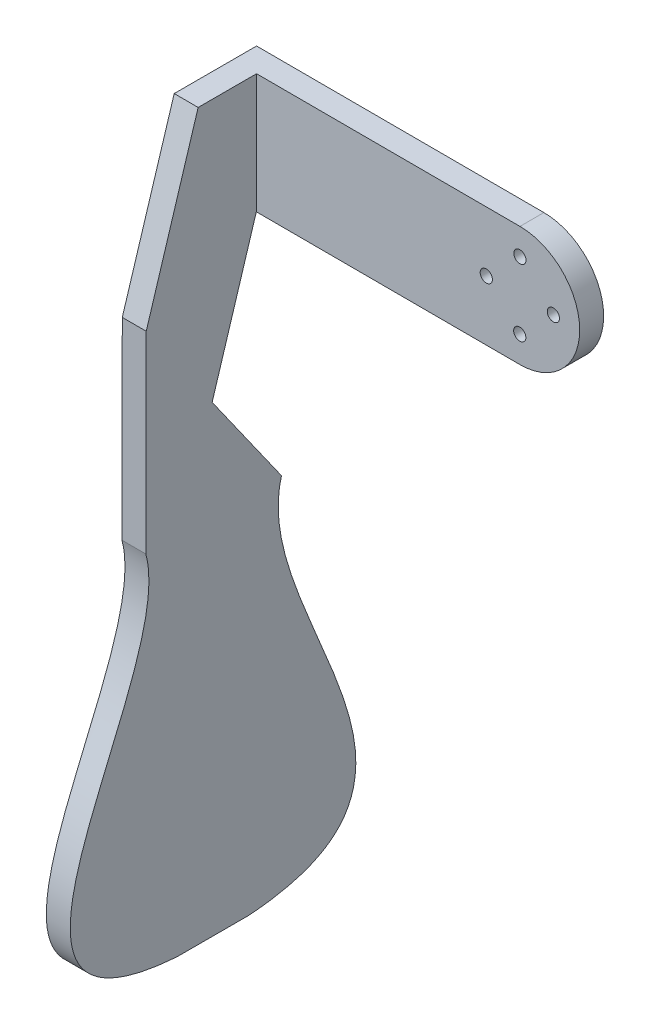
ISO-10303-21;
HEADER;
FILE_DESCRIPTION(('STEP AP214'),'2;1');
FILE_NAME('part.step','',(''),(''),'','','');
FILE_SCHEMA(('AUTOMOTIVE_DESIGN { 1 0 10303 214 1 1 1 1 }'));
ENDSEC;
DATA;
#1=APPLICATION_CONTEXT('core data for automotive mechanical design processes');
#2=APPLICATION_PROTOCOL_DEFINITION('international standard','automotive_design',2000,#1);
#3=PRODUCT_CONTEXT('',#1,'mechanical');
#4=PRODUCT('Part','Part','',(#3));
#5=PRODUCT_RELATED_PRODUCT_CATEGORY('part','',(#4));
#6=PRODUCT_DEFINITION_FORMATION('','',#4);
#7=PRODUCT_DEFINITION_CONTEXT('part definition',#1,'design');
#8=PRODUCT_DEFINITION('design','',#6,#7);
#9=PRODUCT_DEFINITION_SHAPE('','',#8);
#10=(LENGTH_UNIT() NAMED_UNIT(*) SI_UNIT(.MILLI.,.METRE.));
#11=(NAMED_UNIT(*) PLANE_ANGLE_UNIT() SI_UNIT($,.RADIAN.));
#12=(NAMED_UNIT(*) SI_UNIT($,.STERADIAN.) SOLID_ANGLE_UNIT());
#13=UNCERTAINTY_MEASURE_WITH_UNIT(LENGTH_MEASURE(1.E-05),#10,'distance_accuracy_value','');
#14=(GEOMETRIC_REPRESENTATION_CONTEXT(3) GLOBAL_UNCERTAINTY_ASSIGNED_CONTEXT((#13)) GLOBAL_UNIT_ASSIGNED_CONTEXT((#10,
#11,#12)) REPRESENTATION_CONTEXT('',''));
#15=CARTESIAN_POINT('',(0.,0.,0.));
#16=DIRECTION('',(0.,0.,1.));
#17=DIRECTION('',(1.,0.,0.));
#18=AXIS2_PLACEMENT_3D('',#15,#16,#17);
#19=CARTESIAN_POINT('',(0.,0.,3.));
#20=DIRECTION('',(0.,0.,1.));
#21=DIRECTION('',(1.,0.,0.));
#22=AXIS2_PLACEMENT_3D('',#19,#20,#21);
#23=PLANE('',#22);
#24=DIRECTION('',(-0.0020363344066826,-0.999997926668943,0.));
#25=VECTOR('',#24,1.);
#26=CARTESIAN_POINT('',(-54.9744317867084,12.6119724757293,3.));
#27=LINE('',#26,#25);
#28=CARTESIAN_POINT('',(-54.9744317867084,12.6119724757293,3.));
#29=VERTEX_POINT('',#28);
#30=CARTESIAN_POINT('',(-55.0253401468754,-12.3879756909943,3.));
#31=VERTEX_POINT('',#30);
#32=EDGE_CURVE('E49',#29,#31,#27,.T.);
#33=ORIENTED_EDGE('',*,*,#32,.T.);
#34=DIRECTION('',(0.999997926668943,-0.00203633440668162,0.));
#35=VECTOR('',#34,1.);
#36=CARTESIAN_POINT('',(-0.0254541800835499,-12.4999740833618,3.));
#37=LINE('',#36,#35);
#38=CARTESIAN_POINT('',(-0.0254541800835499,-12.4999740833618,3.));
#39=VERTEX_POINT('',#38);
#40=EDGE_CURVE('E249',#31,#39,#37,.T.);
#41=ORIENTED_EDGE('',*,*,#40,.T.);
#42=CARTESIAN_POINT('',(0.,0.,3.));
#43=DIRECTION('',(0.,0.,1.));
#44=DIRECTION('',(1.,0.,0.));
#45=AXIS2_PLACEMENT_3D('',#42,#43,#44);
#46=CIRCLE('',#45,12.5);
#47=CARTESIAN_POINT('',(0.0254541800835013,12.4999740833618,3.));
#48=VERTEX_POINT('',#47);
#49=EDGE_CURVE('E226',#39,#48,#46,.T.);
#50=ORIENTED_EDGE('',*,*,#49,.T.);
#51=DIRECTION('',(-0.999997926668943,0.00203633440668255,0.));
#52=VECTOR('',#51,1.);
#53=CARTESIAN_POINT('',(0.0254541800835013,12.4999740833618,3.));
#54=LINE('',#53,#52);
#55=EDGE_CURVE('E54',#48,#29,#54,.T.);
#56=ORIENTED_EDGE('',*,*,#55,.T.);
#57=EDGE_LOOP('',(#33,#41,#50,#56));
#58=FACE_BOUND('',#57,.T.);
#59=CARTESIAN_POINT('',(0.0142543408467484,6.99998548668259,3.));
#60=DIRECTION('',(0.,0.,1.));
#61=DIRECTION('',(-1.,0.,0.));
#62=AXIS2_PLACEMENT_3D('',#59,#60,#61);
#63=CIRCLE('',#62,1.275);
#64=CARTESIAN_POINT('',(-1.26074565915325,6.99998548668259,3.));
#65=VERTEX_POINT('',#64);
#66=EDGE_CURVE('E262',#65,#65,#63,.T.);
#67=ORIENTED_EDGE('',*,*,#66,.F.);
#68=EDGE_LOOP('',(#67));
#69=FACE_BOUND('',#68,.T.);
#70=CARTESIAN_POINT('',(6.99998548668257,-0.0142543408467744,3.));
#71=DIRECTION('',(0.,0.,1.));
#72=DIRECTION('',(1.,0.,0.));
#73=AXIS2_PLACEMENT_3D('',#70,#71,#72);
#74=CIRCLE('',#73,1.27499999999999);
#75=CARTESIAN_POINT('',(8.27498548668256,-0.0142543408467744,3.));
#76=VERTEX_POINT('',#75);
#77=EDGE_CURVE('E11',#76,#76,#74,.T.);
#78=ORIENTED_EDGE('',*,*,#77,.F.);
#79=EDGE_LOOP('',(#78));
#80=FACE_BOUND('',#79,.T.);
#81=CARTESIAN_POINT('',(-6.99998548668262,0.0142543408467753,3.));
#82=DIRECTION('',(0.,0.,1.));
#83=DIRECTION('',(-1.,0.,0.));
#84=AXIS2_PLACEMENT_3D('',#81,#82,#83);
#85=CIRCLE('',#84,1.275);
#86=CARTESIAN_POINT('',(-8.27498548668262,0.0142543408467753,3.));
#87=VERTEX_POINT('',#86);
#88=EDGE_CURVE('E42',#87,#87,#85,.T.);
#89=ORIENTED_EDGE('',*,*,#88,.F.);
#90=EDGE_LOOP('',(#89));
#91=FACE_BOUND('',#90,.T.);
#92=CARTESIAN_POINT('',(-0.0142543408468025,-6.9999854866826,3.));
#93=DIRECTION('',(0.,0.,1.));
#94=DIRECTION('',(1.,0.,0.));
#95=AXIS2_PLACEMENT_3D('',#92,#93,#94);
#96=CIRCLE('',#95,1.275);
#97=CARTESIAN_POINT('',(1.26074565915319,-6.9999854866826,3.));
#98=VERTEX_POINT('',#97);
#99=EDGE_CURVE('E255',#98,#98,#96,.T.);
#100=ORIENTED_EDGE('',*,*,#99,.F.);
#101=EDGE_LOOP('',(#100));
#102=FACE_BOUND('',#101,.T.);
#103=ADVANCED_FACE('F35',(#58,#69,#80,#91,#102),#23,.T.);
#104=CARTESIAN_POINT('',(6.99998548668257,-0.0142543408467744,3.));
#105=DIRECTION('',(0.,0.,-1.));
#106=DIRECTION('',(-1.,0.,0.));
#107=AXIS2_PLACEMENT_3D('',#104,#105,#106);
#108=CYLINDRICAL_SURFACE('',#107,1.27499999999999);
#109=ORIENTED_EDGE('',*,*,#77,.T.);
#110=EDGE_LOOP('',(#109));
#111=FACE_BOUND('',#110,.T.);
#112=CARTESIAN_POINT('',(6.99998548668257,-0.0142543408467744,-2.));
#113=DIRECTION('',(0.,0.,1.));
#114=DIRECTION('',(1.,0.,0.));
#115=AXIS2_PLACEMENT_3D('',#112,#113,#114);
#116=CIRCLE('',#115,1.275);
#117=CARTESIAN_POINT('',(8.27498548668257,-0.0142543408467744,-2.));
#118=VERTEX_POINT('',#117);
#119=EDGE_CURVE('E224',#118,#118,#116,.T.);
#120=ORIENTED_EDGE('',*,*,#119,.F.);
#121=EDGE_LOOP('',(#120));
#122=FACE_BOUND('',#121,.T.);
#123=ADVANCED_FACE('F213',(#111,#122),#108,.F.);
#124=CARTESIAN_POINT('',(-6.99998548668262,0.0142543408467753,3.));
#125=DIRECTION('',(0.,0.,-1.));
#126=DIRECTION('',(-1.,0.,0.));
#127=AXIS2_PLACEMENT_3D('',#124,#125,#126);
#128=CYLINDRICAL_SURFACE('',#127,1.275);
#129=ORIENTED_EDGE('',*,*,#88,.T.);
#130=EDGE_LOOP('',(#129));
#131=FACE_BOUND('',#130,.T.);
#132=CARTESIAN_POINT('',(-6.99998548668262,0.014254340846777,-2.));
#133=DIRECTION('',(0.,0.,1.));
#134=DIRECTION('',(-1.,0.,0.));
#135=AXIS2_PLACEMENT_3D('',#132,#133,#134);
#136=CIRCLE('',#135,1.275);
#137=CARTESIAN_POINT('',(-8.27498548668262,0.014254340846777,-2.));
#138=VERTEX_POINT('',#137);
#139=EDGE_CURVE('E227',#138,#138,#136,.T.);
#140=ORIENTED_EDGE('',*,*,#139,.F.);
#141=EDGE_LOOP('',(#140));
#142=FACE_BOUND('',#141,.T.);
#143=ADVANCED_FACE('F210',(#131,#142),#128,.F.);
#144=CARTESIAN_POINT('',(0.0142543408467484,6.99998548668259,3.));
#145=DIRECTION('',(0.,0.,-1.));
#146=DIRECTION('',(-1.,0.,0.));
#147=AXIS2_PLACEMENT_3D('',#144,#145,#146);
#148=CYLINDRICAL_SURFACE('',#147,1.275);
#149=ORIENTED_EDGE('',*,*,#66,.T.);
#150=EDGE_LOOP('',(#149));
#151=FACE_BOUND('',#150,.T.);
#152=CARTESIAN_POINT('',(0.0142543408467449,6.9999854866826,-2.));
#153=DIRECTION('',(0.,0.,1.));
#154=DIRECTION('',(-1.,0.,0.));
#155=AXIS2_PLACEMENT_3D('',#152,#153,#154);
#156=CIRCLE('',#155,1.275);
#157=CARTESIAN_POINT('',(-1.26074565915326,6.9999854866826,-2.));
#158=VERTEX_POINT('',#157);
#159=EDGE_CURVE('E231',#158,#158,#156,.T.);
#160=ORIENTED_EDGE('',*,*,#159,.F.);
#161=EDGE_LOOP('',(#160));
#162=FACE_BOUND('',#161,.T.);
#163=ADVANCED_FACE('F206',(#151,#162),#148,.F.);
#164=CARTESIAN_POINT('',(-0.0142543408468025,-6.9999854866826,3.));
#165=DIRECTION('',(0.,0.,-1.));
#166=DIRECTION('',(-1.,0.,0.));
#167=AXIS2_PLACEMENT_3D('',#164,#165,#166);
#168=CYLINDRICAL_SURFACE('',#167,1.275);
#169=ORIENTED_EDGE('',*,*,#99,.T.);
#170=EDGE_LOOP('',(#169));
#171=FACE_BOUND('',#170,.T.);
#172=CARTESIAN_POINT('',(-0.014254340846803,-6.9999854866826,-2.));
#173=DIRECTION('',(0.,0.,1.));
#174=DIRECTION('',(1.,0.,0.));
#175=AXIS2_PLACEMENT_3D('',#172,#173,#174);
#176=CIRCLE('',#175,1.275);
#177=CARTESIAN_POINT('',(1.2607456591532,-6.9999854866826,-2.));
#178=VERTEX_POINT('',#177);
#179=EDGE_CURVE('E273',#178,#178,#176,.T.);
#180=ORIENTED_EDGE('',*,*,#179,.F.);
#181=EDGE_LOOP('',(#180));
#182=FACE_BOUND('',#181,.T.);
#183=ADVANCED_FACE('F202',(#171,#182),#168,.F.);
#184=CARTESIAN_POINT('',(0.,0.,-2.));
#185=DIRECTION('',(0.,0.,1.));
#186=DIRECTION('',(1.,0.,0.));
#187=AXIS2_PLACEMENT_3D('',#184,#185,#186);
#188=CYLINDRICAL_SURFACE('',#187,12.5);
#189=ORIENTED_EDGE('',*,*,#49,.F.);
#190=DIRECTION('',(0.,0.,1.));
#191=VECTOR('',#190,1.);
#192=CARTESIAN_POINT('',(-0.0254541800835499,-12.4999740833618,-2.));
#193=LINE('',#192,#191);
#194=CARTESIAN_POINT('',(-0.0254541800835499,-12.4999740833618,-2.));
#195=VERTEX_POINT('',#194);
#196=EDGE_CURVE('E252',#195,#39,#193,.T.);
#197=ORIENTED_EDGE('',*,*,#196,.F.);
#198=CARTESIAN_POINT('',(0.,0.,-2.));
#199=DIRECTION('',(0.,0.,1.));
#200=DIRECTION('',(1.,0.,0.));
#201=AXIS2_PLACEMENT_3D('',#198,#199,#200);
#202=CIRCLE('',#201,12.5);
#203=CARTESIAN_POINT('',(0.0254541800835013,12.4999740833618,-2.));
#204=VERTEX_POINT('',#203);
#205=EDGE_CURVE('E235',#195,#204,#202,.T.);
#206=ORIENTED_EDGE('',*,*,#205,.T.);
#207=DIRECTION('',(0.,0.,1.));
#208=VECTOR('',#207,1.);
#209=CARTESIAN_POINT('',(0.0254541800835013,12.4999740833618,-2.));
#210=LINE('',#209,#208);
#211=EDGE_CURVE('E246',#204,#48,#210,.T.);
#212=ORIENTED_EDGE('',*,*,#211,.T.);
#213=EDGE_LOOP('',(#189,#197,#206,#212));
#214=FACE_BOUND('',#213,.T.);
#215=ADVANCED_FACE('F193',(#214),#188,.T.);
#216=CARTESIAN_POINT('',(-0.0254541800835499,-12.4999740833618,-2.));
#217=DIRECTION('',(-0.00203633440668162,-0.999997926668943,0.));
#218=DIRECTION('',(0.999997926668943,-0.00203633440668162,0.));
#219=AXIS2_PLACEMENT_3D('',#216,#217,#218);
#220=PLANE('',#219);
#221=CARTESIAN_POINT('',(-60.0253297802201,-12.3777940189609,3.));
#222=VERTEX_POINT('',#221);
#223=EDGE_CURVE('E239',#222,#31,#37,.T.);
#224=ORIENTED_EDGE('',*,*,#223,.F.);
#225=DIRECTION('',(0.,0.,1.));
#226=VECTOR('',#225,1.);
#227=CARTESIAN_POINT('',(-60.0253297802201,-12.3777940189609,-2.));
#228=LINE('',#227,#226);
#229=CARTESIAN_POINT('',(-60.0253297802201,-12.3777940189609,-2.));
#230=VERTEX_POINT('',#229);
#231=EDGE_CURVE('E256',#230,#222,#228,.T.);
#232=ORIENTED_EDGE('',*,*,#231,.F.);
#233=DIRECTION('',(0.999997926668943,-0.00203633440668162,0.));
#234=VECTOR('',#233,1.);
#235=CARTESIAN_POINT('',(-0.0254541800835499,-12.4999740833618,-2.));
#236=LINE('',#235,#234);
#237=EDGE_CURVE('E244',#230,#195,#236,.T.);
#238=ORIENTED_EDGE('',*,*,#237,.T.);
#239=ORIENTED_EDGE('',*,*,#196,.T.);
#240=ORIENTED_EDGE('',*,*,#40,.F.);
#241=EDGE_LOOP('',(#224,#232,#238,#239,#240));
#242=FACE_BOUND('',#241,.T.);
#243=ADVANCED_FACE('F189',(#242),#220,.T.);
#244=CARTESIAN_POINT('',(-60.0253297802201,-12.3777940189609,-2.));
#245=DIRECTION('',(-0.999997926668943,0.00203633440668233,0.));
#246=DIRECTION('',(-0.00203633440668233,-0.999997926668943,0.));
#247=AXIS2_PLACEMENT_3D('',#244,#245,#246);
#248=PLANE('',#247);
#249=ORIENTED_EDGE('',*,*,#231,.T.);
#250=DIRECTION('',(-0.0019468647397366,-0.956061389943035,0.29316007295994));
#251=VECTOR('',#250,1.);
#252=CARTESIAN_POINT('',(-60.0253297802201,-12.3777940189609,3.));
#253=LINE('',#252,#251);
#254=CARTESIAN_POINT('',(-60.0862086271299,-42.2740234830378,12.1671736805919));
#255=VERTEX_POINT('',#254);
#256=EDGE_CURVE('E308',#222,#255,#253,.T.);
#257=ORIENTED_EDGE('',*,*,#256,.T.);
#258=DIRECTION('',(-0.00166311227156301,-0.816716948809113,-0.577036099031512));
#259=VECTOR('',#258,1.);
#260=CARTESIAN_POINT('',(-60.1280478389625,-62.8203173278689,-2.34942630801388));
#261=LINE('',#260,#259);
#262=CARTESIAN_POINT('',(-60.1280478389625,-62.8203173278689,-2.34942630801388));
#263=VERTEX_POINT('',#262);
#264=EDGE_CURVE('E302',#255,#263,#261,.T.);
#265=ORIENTED_EDGE('',*,*,#264,.T.);
#266=CARTESIAN_POINT('',(-60.1280478389625,-62.8203173278689,-2.34942630801388));
#267=CARTESIAN_POINT('',(-60.1780391369846,-87.3699169464711,4.50924851770427));
#268=CARTESIAN_POINT('',(-60.2760077256561,-135.480082560041,-45.4262710400087));
#269=CARTESIAN_POINT('',(-60.2833498207589,-139.085619968892,4.31057369198615));
#270=B_SPLINE_CURVE_WITH_KNOTS('',3,(#266,#267,#268,#269),.UNSPECIFIED.,.F.,.F.,(4,4),(0.,1.),.UNSPECIFIED.);
#271=CARTESIAN_POINT('',(-60.2833498207589,-139.085619968892,4.31057369198615));
#272=VERTEX_POINT('',#271);
#273=EDGE_CURVE('E297',#263,#272,#270,.T.);
#274=ORIENTED_EDGE('',*,*,#273,.T.);
#275=DIRECTION('',(0.,0.,1.));
#276=VECTOR('',#275,1.);
#277=CARTESIAN_POINT('',(-60.2833498207589,-139.085619968892,4.31057369198615));
#278=LINE('',#277,#276);
#279=CARTESIAN_POINT('',(-60.2833498207589,-139.085619968892,19.3105736919861));
#280=VERTEX_POINT('',#279);
#281=EDGE_CURVE('E291',#272,#280,#278,.T.);
#282=ORIENTED_EDGE('',*,*,#281,.T.);
#283=CARTESIAN_POINT('',(-60.2833498207589,-139.085619968892,19.3105736919861));
#284=CARTESIAN_POINT('',(-60.2760077256561,-135.480082560038,69.0474184239774));
#285=CARTESIAN_POINT('',(-60.1780391369846,-87.3699169464714,19.1118988662634));
#286=CARTESIAN_POINT('',(-60.1280478389625,-62.8203173278689,25.9705736919862));
#287=B_SPLINE_CURVE_WITH_KNOTS('',3,(#283,#284,#285,#286),.UNSPECIFIED.,.F.,.F.,(4,4),(0.,1.),.UNSPECIFIED.);
#288=CARTESIAN_POINT('',(-60.1280478389625,-62.8203173278689,25.9705736919862));
#289=VERTEX_POINT('',#288);
#290=EDGE_CURVE('E145',#280,#289,#287,.T.);
#291=ORIENTED_EDGE('',*,*,#290,.T.);
#292=DIRECTION('',(0.00203633440668247,0.999997926668943,0.));
#293=VECTOR('',#292,1.);
#294=CARTESIAN_POINT('',(-60.1280478389625,-62.8203173278689,25.9705736919862));
#295=LINE('',#294,#293);
#296=CARTESIAN_POINT('',(-60.0459531068056,-22.5054448403736,25.9705736919861));
#297=VERTEX_POINT('',#296);
#298=EDGE_CURVE('E142',#289,#297,#295,.T.);
#299=ORIENTED_EDGE('',*,*,#298,.T.);
#300=DIRECTION('',(0.00194686473973669,0.956061389943035,-0.29316007295994));
#301=VECTOR('',#300,1.);
#302=CARTESIAN_POINT('',(-59.9744214200531,12.6221541477627,15.1992889286895));
#303=LINE('',#302,#301);
#304=CARTESIAN_POINT('',(-59.9744214200531,12.6221541477627,15.1992889286895));
#305=VERTEX_POINT('',#304);
#306=EDGE_CURVE('E311',#297,#305,#303,.T.);
#307=ORIENTED_EDGE('',*,*,#306,.T.);
#308=DIRECTION('',(0.,0.,1.));
#309=VECTOR('',#308,1.);
#310=CARTESIAN_POINT('',(-59.9744214200531,12.6221541477627,-2.));
#311=LINE('',#310,#309);
#312=CARTESIAN_POINT('',(-59.9744214200531,12.6221541477627,-2.));
#313=VERTEX_POINT('',#312);
#314=EDGE_CURVE('E124',#313,#305,#311,.T.);
#315=ORIENTED_EDGE('',*,*,#314,.F.);
#316=DIRECTION('',(-0.00203633440668233,-0.999997926668943,0.));
#317=VECTOR('',#316,1.);
#318=CARTESIAN_POINT('',(-60.0253297802201,-12.3777940189609,-2.));
#319=LINE('',#318,#317);
#320=EDGE_CURVE('E241',#313,#230,#319,.T.);
#321=ORIENTED_EDGE('',*,*,#320,.T.);
#322=EDGE_LOOP('',(#249,#257,#265,#274,#282,#291,#299,#307,#315,#321));
#323=FACE_BOUND('',#322,.T.);
#324=ADVANCED_FACE('F192',(#323),#248,.T.);
#325=CARTESIAN_POINT('',(0.0254541800835013,12.4999740833618,-2.));
#326=DIRECTION('',(0.00203633440668255,0.999997926668943,0.));
#327=DIRECTION('',(-0.999997926668943,0.00203633440668255,0.));
#328=AXIS2_PLACEMENT_3D('',#325,#326,#327);
#329=PLANE('',#328);
#330=ORIENTED_EDGE('',*,*,#55,.F.);
#331=ORIENTED_EDGE('',*,*,#211,.F.);
#332=DIRECTION('',(-0.999997926668943,0.00203633440668255,0.));
#333=VECTOR('',#332,1.);
#334=CARTESIAN_POINT('',(0.0254541800835013,12.4999740833618,-2.));
#335=LINE('',#334,#333);
#336=EDGE_CURVE('E238',#204,#313,#335,.T.);
#337=ORIENTED_EDGE('',*,*,#336,.T.);
#338=ORIENTED_EDGE('',*,*,#314,.T.);
#339=DIRECTION('',(-0.999997926668943,0.00203633440668236,0.));
#340=VECTOR('',#339,1.);
#341=CARTESIAN_POINT('',(-54.9744317867084,12.6119724757293,15.1992889286895));
#342=LINE('',#341,#340);
#343=CARTESIAN_POINT('',(-54.9744317867084,12.6119724757293,15.1992889286895));
#344=VERTEX_POINT('',#343);
#345=EDGE_CURVE('E119',#344,#305,#342,.T.);
#346=ORIENTED_EDGE('',*,*,#345,.F.);
#347=DIRECTION('',(0.,0.,-1.));
#348=VECTOR('',#347,1.);
#349=CARTESIAN_POINT('',(-54.9744317867084,12.6119724757293,3.));
#350=LINE('',#349,#348);
#351=EDGE_CURVE('E122',#344,#29,#350,.T.);
#352=ORIENTED_EDGE('',*,*,#351,.T.);
#353=EDGE_LOOP('',(#330,#331,#337,#338,#346,#352));
#354=FACE_BOUND('',#353,.T.);
#355=ADVANCED_FACE('F121',(#354),#329,.T.);
#356=CARTESIAN_POINT('',(0.,0.,-2.));
#357=DIRECTION('',(0.,0.,1.));
#358=DIRECTION('',(1.,0.,0.));
#359=AXIS2_PLACEMENT_3D('',#356,#357,#358);
#360=PLANE('',#359);
#361=ORIENTED_EDGE('',*,*,#179,.T.);
#362=EDGE_LOOP('',(#361));
#363=FACE_BOUND('',#362,.T.);
#364=ORIENTED_EDGE('',*,*,#159,.T.);
#365=EDGE_LOOP('',(#364));
#366=FACE_BOUND('',#365,.T.);
#367=ORIENTED_EDGE('',*,*,#139,.T.);
#368=EDGE_LOOP('',(#367));
#369=FACE_BOUND('',#368,.T.);
#370=ORIENTED_EDGE('',*,*,#119,.T.);
#371=EDGE_LOOP('',(#370));
#372=FACE_BOUND('',#371,.T.);
#373=ORIENTED_EDGE('',*,*,#205,.F.);
#374=ORIENTED_EDGE('',*,*,#237,.F.);
#375=ORIENTED_EDGE('',*,*,#320,.F.);
#376=ORIENTED_EDGE('',*,*,#336,.F.);
#377=EDGE_LOOP('',(#373,#374,#375,#376));
#378=FACE_BOUND('',#377,.T.);
#379=ADVANCED_FACE('F185',(#363,#366,#369,#372,#378),#360,.F.);
#380=CARTESIAN_POINT('',(-54.9744317867084,12.6119724757293,15.1992889286895));
#381=DIRECTION('',(0.000596971943233836,0.293159465142056,0.956063372178917));
#382=DIRECTION('',(0.,-0.956063542537744,0.293159517379496));
#383=AXIS2_PLACEMENT_3D('',#380,#381,#382);
#384=PLANE('',#383);
#385=ORIENTED_EDGE('',*,*,#306,.F.);
#386=DIRECTION('',(-0.999997926668943,0.00203633440668236,0.));
#387=VECTOR('',#386,1.);
#388=CARTESIAN_POINT('',(-55.0459634734609,-22.5156265124071,25.9705736919861));
#389=LINE('',#388,#387);
#390=CARTESIAN_POINT('',(-55.0459634734609,-22.5156265124071,25.9705736919861));
#391=VERTEX_POINT('',#390);
#392=EDGE_CURVE('E141',#391,#297,#389,.T.);
#393=ORIENTED_EDGE('',*,*,#392,.F.);
#394=DIRECTION('',(0.00194686473973669,0.956061389943035,-0.29316007295994));
#395=VECTOR('',#394,1.);
#396=CARTESIAN_POINT('',(-54.9744317867084,12.6119724757293,15.1992889286895));
#397=LINE('',#396,#395);
#398=EDGE_CURVE('E136',#391,#344,#397,.T.);
#399=ORIENTED_EDGE('',*,*,#398,.T.);
#400=ORIENTED_EDGE('',*,*,#345,.T.);
#401=EDGE_LOOP('',(#385,#393,#399,#400));
#402=FACE_BOUND('',#401,.T.);
#403=ADVANCED_FACE('F140',(#402),#384,.T.);
#404=CARTESIAN_POINT('',(-55.1280582056178,-62.8304989999023,25.9705736919862));
#405=DIRECTION('',(0.,0.,1.));
#406=DIRECTION('',(0.,-1.,0.));
#407=AXIS2_PLACEMENT_3D('',#404,#405,#406);
#408=PLANE('',#407);
#409=ORIENTED_EDGE('',*,*,#298,.F.);
#410=DIRECTION('',(-0.999997926668943,0.00203633440668236,0.));
#411=VECTOR('',#410,1.);
#412=CARTESIAN_POINT('',(-55.1280582056178,-62.8304989999023,25.9705736919862));
#413=LINE('',#412,#411);
#414=CARTESIAN_POINT('',(-55.1280582056178,-62.8304989999023,25.9705736919862));
#415=VERTEX_POINT('',#414);
#416=EDGE_CURVE('E276',#415,#289,#413,.T.);
#417=ORIENTED_EDGE('',*,*,#416,.F.);
#418=DIRECTION('',(0.00203633440668247,0.999997926668943,0.));
#419=VECTOR('',#418,1.);
#420=CARTESIAN_POINT('',(-55.1280582056178,-62.8304989999023,25.9705736919862));
#421=LINE('',#420,#419);
#422=EDGE_CURVE('E130',#415,#391,#421,.T.);
#423=ORIENTED_EDGE('',*,*,#422,.T.);
#424=ORIENTED_EDGE('',*,*,#392,.T.);
#425=EDGE_LOOP('',(#409,#417,#423,#424));
#426=FACE_BOUND('',#425,.T.);
#427=ADVANCED_FACE('F184',(#426),#408,.T.);
#428=CARTESIAN_POINT('',(-55.2833601874142,-139.095801640926,19.3105736919861));
#429=CARTESIAN_POINT('',(-55.2760180923113,-135.490264232071,69.0474184239774));
#430=CARTESIAN_POINT('',(-55.1780495036399,-87.3800986185049,19.1118988662634));
#431=CARTESIAN_POINT('',(-55.1280582056178,-62.8304989999023,25.9705736919862));
#432=B_SPLINE_CURVE_WITH_KNOTS('',3,(#428,#429,#430,#431),.UNSPECIFIED.,.F.,.F.,(4,4),(0.,1.),.UNSPECIFIED.);
#433=DIRECTION('',(-0.999997926668943,0.00203633440668236,0.));
#434=VECTOR('',#433,1.);
#435=SURFACE_OF_LINEAR_EXTRUSION('',#432,#434);
#436=ORIENTED_EDGE('',*,*,#290,.F.);
#437=DIRECTION('',(-0.999997926668943,0.00203633440668236,0.));
#438=VECTOR('',#437,1.);
#439=CARTESIAN_POINT('',(-55.2833601874142,-139.095801640926,19.3105736919861));
#440=LINE('',#439,#438);
#441=CARTESIAN_POINT('',(-55.2833601874142,-139.095801640926,19.3105736919861));
#442=VERTEX_POINT('',#441);
#443=EDGE_CURVE('E284',#442,#280,#440,.T.);
#444=ORIENTED_EDGE('',*,*,#443,.F.);
#445=EDGE_CURVE('E313',#442,#415,#432,.T.);
#446=ORIENTED_EDGE('',*,*,#445,.T.);
#447=ORIENTED_EDGE('',*,*,#416,.T.);
#448=EDGE_LOOP('',(#436,#444,#446,#447));
#449=FACE_BOUND('',#448,.T.);
#450=ADVANCED_FACE('F321',(#449),#435,.T.);
#451=CARTESIAN_POINT('',(-55.2833601874142,-139.095801640926,4.31057369198615));
#452=DIRECTION('',(-0.00203633440668236,-0.999997926668943,0.));
#453=DIRECTION('',(0.999997926668943,-0.00203633440668236,0.));
#454=AXIS2_PLACEMENT_3D('',#451,#452,#453);
#455=PLANE('',#454);
#456=ORIENTED_EDGE('',*,*,#281,.F.);
#457=DIRECTION('',(-0.999997926668943,0.00203633440668236,0.));
#458=VECTOR('',#457,1.);
#459=CARTESIAN_POINT('',(-55.2833601874142,-139.095801640926,4.31057369198615));
#460=LINE('',#459,#458);
#461=CARTESIAN_POINT('',(-55.2833601874142,-139.095801640926,4.31057369198615));
#462=VERTEX_POINT('',#461);
#463=EDGE_CURVE('E282',#462,#272,#460,.T.);
#464=ORIENTED_EDGE('',*,*,#463,.F.);
#465=DIRECTION('',(0.,0.,1.));
#466=VECTOR('',#465,1.);
#467=CARTESIAN_POINT('',(-55.2833601874142,-139.095801640926,4.31057369198615));
#468=LINE('',#467,#466);
#469=EDGE_CURVE('E161',#462,#442,#468,.T.);
#470=ORIENTED_EDGE('',*,*,#469,.T.);
#471=ORIENTED_EDGE('',*,*,#443,.T.);
#472=EDGE_LOOP('',(#456,#464,#470,#471));
#473=FACE_BOUND('',#472,.T.);
#474=ADVANCED_FACE('F172',(#473),#455,.T.);
#475=CARTESIAN_POINT('',(-55.1280582056178,-62.8304989999023,-2.34942630801388));
#476=CARTESIAN_POINT('',(-55.1780495036399,-87.3800986185045,4.50924851770427));
#477=CARTESIAN_POINT('',(-55.2760180923113,-135.490264232074,-45.4262710400087));
#478=CARTESIAN_POINT('',(-55.2833601874142,-139.095801640926,4.31057369198615));
#479=B_SPLINE_CURVE_WITH_KNOTS('',3,(#475,#476,#477,#478),.UNSPECIFIED.,.F.,.F.,(4,4),(0.,1.),.UNSPECIFIED.);
#480=DIRECTION('',(-0.999997926668943,0.00203633440668236,0.));
#481=VECTOR('',#480,1.);
#482=SURFACE_OF_LINEAR_EXTRUSION('',#479,#481);
#483=ORIENTED_EDGE('',*,*,#273,.F.);
#484=DIRECTION('',(-0.999997926668943,0.00203633440668236,0.));
#485=VECTOR('',#484,1.);
#486=CARTESIAN_POINT('',(-55.1280582056178,-62.8304989999023,-2.34942630801388));
#487=LINE('',#486,#485);
#488=CARTESIAN_POINT('',(-55.1280582056178,-62.8304989999023,-2.34942630801388));
#489=VERTEX_POINT('',#488);
#490=EDGE_CURVE('E280',#489,#263,#487,.T.);
#491=ORIENTED_EDGE('',*,*,#490,.F.);
#492=EDGE_CURVE('E155',#489,#462,#479,.T.);
#493=ORIENTED_EDGE('',*,*,#492,.T.);
#494=ORIENTED_EDGE('',*,*,#463,.T.);
#495=EDGE_LOOP('',(#483,#491,#493,#494));
#496=FACE_BOUND('',#495,.T.);
#497=ADVANCED_FACE('F167',(#496),#482,.T.);
#498=CARTESIAN_POINT('',(-55.1280582056178,-62.8304989999023,-2.34942630801388));
#499=DIRECTION('',(0.00117503846235563,0.577034902644647,-0.816718642137239));
#500=DIRECTION('',(0.,0.816719205965821,0.577035301005544));
#501=AXIS2_PLACEMENT_3D('',#498,#499,#500);
#502=PLANE('',#501);
#503=ORIENTED_EDGE('',*,*,#264,.F.);
#504=DIRECTION('',(-0.999997926668943,0.00203633440668236,0.));
#505=VECTOR('',#504,1.);
#506=CARTESIAN_POINT('',(-55.0862189937852,-42.2842051550712,12.1671736805919));
#507=LINE('',#506,#505);
#508=CARTESIAN_POINT('',(-55.0862189937852,-42.2842051550712,12.1671736805919));
#509=VERTEX_POINT('',#508);
#510=EDGE_CURVE('E129',#509,#255,#507,.T.);
#511=ORIENTED_EDGE('',*,*,#510,.F.);
#512=DIRECTION('',(-0.00166311227156301,-0.816716948809113,-0.577036099031512));
#513=VECTOR('',#512,1.);
#514=CARTESIAN_POINT('',(-55.1280582056178,-62.8304989999023,-2.34942630801388));
#515=LINE('',#514,#513);
#516=EDGE_CURVE('E152',#509,#489,#515,.T.);
#517=ORIENTED_EDGE('',*,*,#516,.T.);
#518=ORIENTED_EDGE('',*,*,#490,.T.);
#519=EDGE_LOOP('',(#503,#511,#517,#518));
#520=FACE_BOUND('',#519,.T.);
#521=ADVANCED_FACE('F171',(#520),#502,.T.);
#522=CARTESIAN_POINT('',(-55.0253401468754,-12.3879756909943,3.));
#523=DIRECTION('',(-0.000596971943233836,-0.293159465142056,-0.956063372178917));
#524=DIRECTION('',(0.,0.956063542537744,-0.293159517379496));
#525=AXIS2_PLACEMENT_3D('',#522,#523,#524);
#526=PLANE('',#525);
#527=ORIENTED_EDGE('',*,*,#256,.F.);
#528=ORIENTED_EDGE('',*,*,#223,.T.);
#529=DIRECTION('',(-0.0019468647397366,-0.956061389943035,0.29316007295994));
#530=VECTOR('',#529,1.);
#531=CARTESIAN_POINT('',(-55.0253401468754,-12.3879756909943,3.));
#532=LINE('',#531,#530);
#533=EDGE_CURVE('E149',#31,#509,#532,.T.);
#534=ORIENTED_EDGE('',*,*,#533,.T.);
#535=ORIENTED_EDGE('',*,*,#510,.T.);
#536=EDGE_LOOP('',(#527,#528,#534,#535));
#537=FACE_BOUND('',#536,.T.);
#538=ADVANCED_FACE('F177',(#537),#526,.T.);
#539=CARTESIAN_POINT('',(-55.2217026476107,-108.81717364907,38.7198874068368));
#540=DIRECTION('',(0.999997926668943,-0.00203633440668237,0.));
#541=DIRECTION('',(0.00203633440668237,0.999997926668943,0.));
#542=AXIS2_PLACEMENT_3D('',#539,#540,#541);
#543=PLANE('',#542);
#544=ORIENTED_EDGE('',*,*,#398,.F.);
#545=ORIENTED_EDGE('',*,*,#422,.F.);
#546=ORIENTED_EDGE('',*,*,#445,.F.);
#547=ORIENTED_EDGE('',*,*,#469,.F.);
#548=ORIENTED_EDGE('',*,*,#492,.F.);
#549=ORIENTED_EDGE('',*,*,#516,.F.);
#550=ORIENTED_EDGE('',*,*,#533,.F.);
#551=ORIENTED_EDGE('',*,*,#32,.F.);
#552=ORIENTED_EDGE('',*,*,#351,.F.);
#553=EDGE_LOOP('',(#544,#545,#546,#547,#548,#549,#550,#551,#552));
#554=FACE_BOUND('',#553,.T.);
#555=ADVANCED_FACE('F134',(#554),#543,.T.);
#556=CLOSED_SHELL('',(#103,#123,#143,#163,#183,#215,#243,#324,#355,#379,#403,#427,#450,#474,
#497,#521,#538,#555));
#557=MANIFOLD_SOLID_BREP('B2',#556);
#558=ADVANCED_BREP_SHAPE_REPRESENTATION('',(#18,#557),#14);
#559=SHAPE_DEFINITION_REPRESENTATION(#9,#558);
ENDSEC;
END-ISO-10303-21;
